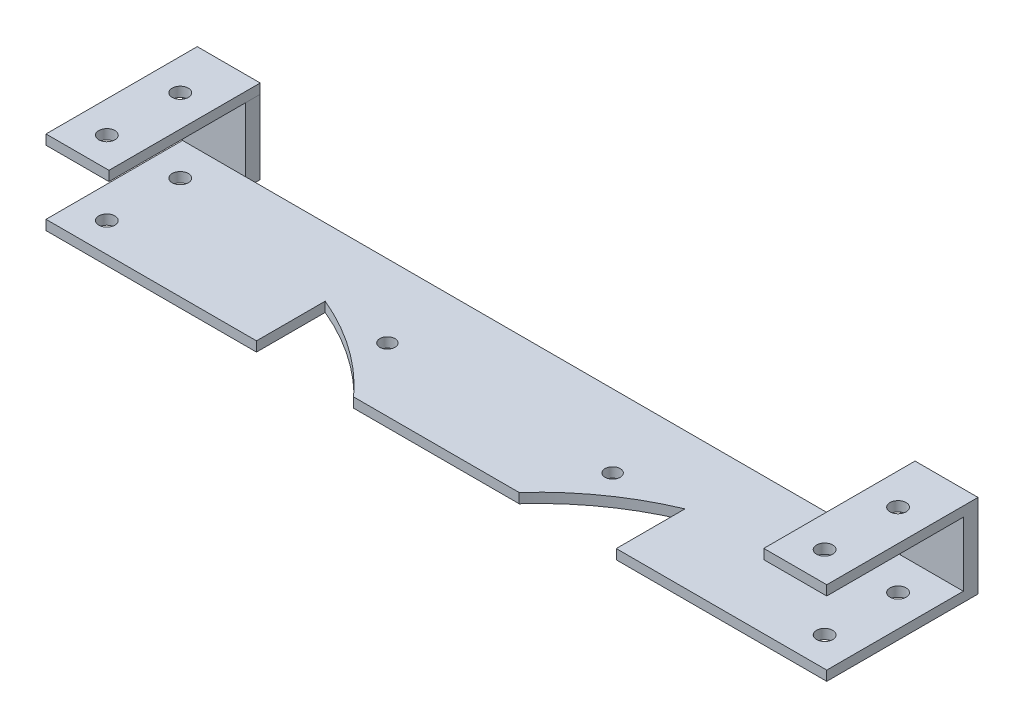
ISO-10303-21;
HEADER;
FILE_DESCRIPTION(('STEP AP214'),'2;1');
FILE_NAME('part.step','',(''),(''),'','','');
FILE_SCHEMA(('AUTOMOTIVE_DESIGN { 1 0 10303 214 1 1 1 1 }'));
ENDSEC;
DATA;
#1=APPLICATION_CONTEXT('core data for automotive mechanical design processes');
#2=APPLICATION_PROTOCOL_DEFINITION('international standard','automotive_design',2000,#1);
#3=PRODUCT_CONTEXT('',#1,'mechanical');
#4=PRODUCT('Part','Part','',(#3));
#5=PRODUCT_RELATED_PRODUCT_CATEGORY('part','',(#4));
#6=PRODUCT_DEFINITION_FORMATION('','',#4);
#7=PRODUCT_DEFINITION_CONTEXT('part definition',#1,'design');
#8=PRODUCT_DEFINITION('design','',#6,#7);
#9=PRODUCT_DEFINITION_SHAPE('','',#8);
#10=(LENGTH_UNIT() NAMED_UNIT(*) SI_UNIT(.MILLI.,.METRE.));
#11=(NAMED_UNIT(*) PLANE_ANGLE_UNIT() SI_UNIT($,.RADIAN.));
#12=(NAMED_UNIT(*) SI_UNIT($,.STERADIAN.) SOLID_ANGLE_UNIT());
#13=UNCERTAINTY_MEASURE_WITH_UNIT(LENGTH_MEASURE(1.E-05),#10,'distance_accuracy_value','');
#14=(GEOMETRIC_REPRESENTATION_CONTEXT(3) GLOBAL_UNCERTAINTY_ASSIGNED_CONTEXT((#13)) GLOBAL_UNIT_ASSIGNED_CONTEXT((#10,
#11,#12)) REPRESENTATION_CONTEXT('',''));
#15=CARTESIAN_POINT('',(0.,0.,0.));
#16=DIRECTION('',(0.,0.,1.));
#17=DIRECTION('',(1.,0.,0.));
#18=AXIS2_PLACEMENT_3D('',#15,#16,#17);
#19=CARTESIAN_POINT('',(-8.64000000000009,17.1,0.));
#20=DIRECTION('',(-1.,0.,0.));
#21=DIRECTION('',(0.,0.,1.));
#22=AXIS2_PLACEMENT_3D('',#19,#20,#21);
#23=PLANE('',#22);
#24=DIRECTION('',(0.,0.,-1.));
#25=VECTOR('',#24,1.);
#26=CARTESIAN_POINT('',(-8.64000000000009,15.1,0.));
#27=LINE('',#26,#25);
#28=CARTESIAN_POINT('',(-8.64000000000002,15.1,-37.4));
#29=VERTEX_POINT('',#28);
#30=CARTESIAN_POINT('',(-8.64000000000001,15.1,-68.3));
#31=VERTEX_POINT('',#30);
#32=EDGE_CURVE('E121',#29,#31,#27,.T.);
#33=ORIENTED_EDGE('',*,*,#32,.T.);
#34=DIRECTION('',(0.,-1.,0.));
#35=VECTOR('',#34,1.);
#36=CARTESIAN_POINT('',(-8.64000000000001,17.1,-68.3));
#37=LINE('',#36,#35);
#38=CARTESIAN_POINT('',(-8.64000000000001,17.1,-68.3));
#39=VERTEX_POINT('',#38);
#40=EDGE_CURVE('E12',#39,#31,#37,.T.);
#41=ORIENTED_EDGE('',*,*,#40,.F.);
#42=DIRECTION('',(0.,0.,-1.));
#43=VECTOR('',#42,1.);
#44=CARTESIAN_POINT('',(-8.64000000000009,17.1,0.));
#45=LINE('',#44,#43);
#46=CARTESIAN_POINT('',(-8.64000000000002,17.1,-37.4));
#47=VERTEX_POINT('',#46);
#48=EDGE_CURVE('E101',#47,#39,#45,.T.);
#49=ORIENTED_EDGE('',*,*,#48,.F.);
#50=DIRECTION('',(0.,-1.,0.));
#51=VECTOR('',#50,1.);
#52=CARTESIAN_POINT('',(-8.64000000000002,17.1,-37.4));
#53=LINE('',#52,#51);
#54=EDGE_CURVE('E67',#47,#29,#53,.T.);
#55=ORIENTED_EDGE('',*,*,#54,.T.);
#56=EDGE_LOOP('',(#33,#41,#49,#55));
#57=FACE_BOUND('',#56,.T.);
#58=ADVANCED_FACE('F51',(#57),#23,.F.);
#59=CARTESIAN_POINT('',(0.,17.1,-68.3));
#60=DIRECTION('',(0.,0.,1.));
#61=DIRECTION('',(1.,0.,0.));
#62=AXIS2_PLACEMENT_3D('',#59,#60,#61);
#63=PLANE('',#62);
#64=DIRECTION('',(-1.,0.,0.));
#65=VECTOR('',#64,1.);
#66=CARTESIAN_POINT('',(0.,15.1,-68.3));
#67=LINE('',#66,#65);
#68=CARTESIAN_POINT('',(-21.5,15.1,-68.3));
#69=VERTEX_POINT('',#68);
#70=EDGE_CURVE('E106',#31,#69,#67,.T.);
#71=ORIENTED_EDGE('',*,*,#70,.T.);
#72=DIRECTION('',(0.,-1.,0.));
#73=VECTOR('',#72,1.);
#74=CARTESIAN_POINT('',(-21.5,17.1,-68.3));
#75=LINE('',#74,#73);
#76=CARTESIAN_POINT('',(-21.5,17.1,-68.3));
#77=VERTEX_POINT('',#76);
#78=EDGE_CURVE('E59',#77,#69,#75,.T.);
#79=ORIENTED_EDGE('',*,*,#78,.F.);
#80=DIRECTION('',(-1.,0.,0.));
#81=VECTOR('',#80,1.);
#82=CARTESIAN_POINT('',(0.,17.1,-68.3));
#83=LINE('',#82,#81);
#84=EDGE_CURVE('E93',#39,#77,#83,.T.);
#85=ORIENTED_EDGE('',*,*,#84,.F.);
#86=ORIENTED_EDGE('',*,*,#40,.T.);
#87=EDGE_LOOP('',(#71,#79,#85,#86));
#88=FACE_BOUND('',#87,.T.);
#89=ADVANCED_FACE('F105',(#88),#63,.F.);
#90=CARTESIAN_POINT('',(-21.4999999999999,17.1,0.));
#91=DIRECTION('',(1.,0.,0.));
#92=DIRECTION('',(0.,0.,-1.));
#93=AXIS2_PLACEMENT_3D('',#90,#91,#92);
#94=PLANE('',#93);
#95=DIRECTION('',(0.,0.,1.));
#96=VECTOR('',#95,1.);
#97=CARTESIAN_POINT('',(-21.4999999999999,15.1,0.));
#98=LINE('',#97,#96);
#99=CARTESIAN_POINT('',(-21.5,15.1,-37.4));
#100=VERTEX_POINT('',#99);
#101=EDGE_CURVE('E124',#69,#100,#98,.T.);
#102=ORIENTED_EDGE('',*,*,#101,.T.);
#103=DIRECTION('',(0.,-1.,0.));
#104=VECTOR('',#103,1.);
#105=CARTESIAN_POINT('',(-21.5,17.1,-37.4));
#106=LINE('',#105,#104);
#107=CARTESIAN_POINT('',(-21.5,17.1,-37.4));
#108=VERTEX_POINT('',#107);
#109=EDGE_CURVE('E82',#108,#100,#106,.T.);
#110=ORIENTED_EDGE('',*,*,#109,.F.);
#111=DIRECTION('',(0.,0.,1.));
#112=VECTOR('',#111,1.);
#113=CARTESIAN_POINT('',(-21.4999999999999,17.1,0.));
#114=LINE('',#113,#112);
#115=EDGE_CURVE('E100',#77,#108,#114,.T.);
#116=ORIENTED_EDGE('',*,*,#115,.F.);
#117=ORIENTED_EDGE('',*,*,#78,.T.);
#118=EDGE_LOOP('',(#102,#110,#116,#117));
#119=FACE_BOUND('',#118,.T.);
#120=ADVANCED_FACE('F109',(#119),#94,.F.);
#121=CARTESIAN_POINT('',(-15.07,17.1,-43.4));
#122=DIRECTION('',(0.,-1.,0.));
#123=DIRECTION('',(0.,0.,-1.));
#124=AXIS2_PLACEMENT_3D('',#121,#122,#123);
#125=CYLINDRICAL_SURFACE('',#124,1.65);
#126=CARTESIAN_POINT('',(-15.07,17.1,-43.4));
#127=DIRECTION('',(0.,1.,0.));
#128=DIRECTION('',(0.,0.,1.));
#129=AXIS2_PLACEMENT_3D('',#126,#127,#128);
#130=CIRCLE('',#129,1.65);
#131=CARTESIAN_POINT('',(-15.07,17.1,-41.75));
#132=VERTEX_POINT('',#131);
#133=EDGE_CURVE('E112',#132,#132,#130,.F.);
#134=ORIENTED_EDGE('',*,*,#133,.F.);
#135=EDGE_LOOP('',(#134));
#136=FACE_BOUND('',#135,.T.);
#137=CARTESIAN_POINT('',(-15.07,15.1,-43.4));
#138=DIRECTION('',(0.,1.,0.));
#139=DIRECTION('',(0.,0.,1.));
#140=AXIS2_PLACEMENT_3D('',#137,#138,#139);
#141=CIRCLE('',#140,1.65);
#142=CARTESIAN_POINT('',(-15.07,15.1,-41.75));
#143=VERTEX_POINT('',#142);
#144=EDGE_CURVE('E129',#143,#143,#141,.F.);
#145=ORIENTED_EDGE('',*,*,#144,.T.);
#146=EDGE_LOOP('',(#145));
#147=FACE_BOUND('',#146,.T.);
#148=ADVANCED_FACE('F156',(#136,#147),#125,.F.);
#149=CARTESIAN_POINT('',(0.,17.1,-37.4));
#150=DIRECTION('',(0.,0.,1.));
#151=DIRECTION('',(1.,0.,0.));
#152=AXIS2_PLACEMENT_3D('',#149,#150,#151);
#153=PLANE('',#152);
#154=DIRECTION('',(-1.,0.,0.));
#155=VECTOR('',#154,1.);
#156=CARTESIAN_POINT('',(0.,15.1,-37.4));
#157=LINE('',#156,#155);
#158=EDGE_CURVE('E126',#29,#100,#157,.T.);
#159=ORIENTED_EDGE('',*,*,#158,.F.);
#160=ORIENTED_EDGE('',*,*,#54,.F.);
#161=DIRECTION('',(-1.,0.,0.));
#162=VECTOR('',#161,1.);
#163=CARTESIAN_POINT('',(0.,17.1,-37.4));
#164=LINE('',#163,#162);
#165=EDGE_CURVE('E110',#47,#108,#164,.T.);
#166=ORIENTED_EDGE('',*,*,#165,.T.);
#167=ORIENTED_EDGE('',*,*,#109,.T.);
#168=EDGE_LOOP('',(#159,#160,#166,#167));
#169=FACE_BOUND('',#168,.T.);
#170=ADVANCED_FACE('F154',(#169),#153,.T.);
#171=CARTESIAN_POINT('',(-15.07,17.1,-58.4));
#172=DIRECTION('',(0.,-1.,0.));
#173=DIRECTION('',(0.,0.,-1.));
#174=AXIS2_PLACEMENT_3D('',#171,#172,#173);
#175=CYLINDRICAL_SURFACE('',#174,1.65);
#176=CARTESIAN_POINT('',(-15.07,17.1,-58.4));
#177=DIRECTION('',(0.,1.,0.));
#178=DIRECTION('',(0.,0.,1.));
#179=AXIS2_PLACEMENT_3D('',#176,#177,#178);
#180=CIRCLE('',#179,1.65);
#181=CARTESIAN_POINT('',(-15.07,17.1,-56.75));
#182=VERTEX_POINT('',#181);
#183=EDGE_CURVE('E118',#182,#182,#180,.F.);
#184=ORIENTED_EDGE('',*,*,#183,.F.);
#185=EDGE_LOOP('',(#184));
#186=FACE_BOUND('',#185,.T.);
#187=CARTESIAN_POINT('',(-15.07,15.1,-58.4));
#188=DIRECTION('',(0.,1.,0.));
#189=DIRECTION('',(0.,0.,1.));
#190=AXIS2_PLACEMENT_3D('',#187,#188,#189);
#191=CIRCLE('',#190,1.65);
#192=CARTESIAN_POINT('',(-15.07,15.1,-56.75));
#193=VERTEX_POINT('',#192);
#194=EDGE_CURVE('E132',#193,#193,#191,.F.);
#195=ORIENTED_EDGE('',*,*,#194,.T.);
#196=EDGE_LOOP('',(#195));
#197=FACE_BOUND('',#196,.T.);
#198=ADVANCED_FACE('F138',(#186,#197),#175,.F.);
#199=CARTESIAN_POINT('',(0.,17.1,0.));
#200=DIRECTION('',(0.,1.,0.));
#201=DIRECTION('',(0.,0.,1.));
#202=AXIS2_PLACEMENT_3D('',#199,#200,#201);
#203=PLANE('',#202);
#204=ORIENTED_EDGE('',*,*,#48,.T.);
#205=ORIENTED_EDGE('',*,*,#84,.T.);
#206=ORIENTED_EDGE('',*,*,#115,.T.);
#207=ORIENTED_EDGE('',*,*,#165,.F.);
#208=EDGE_LOOP('',(#204,#205,#206,#207));
#209=FACE_BOUND('',#208,.T.);
#210=ORIENTED_EDGE('',*,*,#133,.T.);
#211=EDGE_LOOP('',(#210));
#212=FACE_BOUND('',#211,.T.);
#213=ORIENTED_EDGE('',*,*,#183,.T.);
#214=EDGE_LOOP('',(#213));
#215=FACE_BOUND('',#214,.T.);
#216=ADVANCED_FACE('F96',(#209,#212,#215),#203,.T.);
#217=CARTESIAN_POINT('',(0.,15.1,0.));
#218=DIRECTION('',(0.,1.,0.));
#219=DIRECTION('',(0.,0.,1.));
#220=AXIS2_PLACEMENT_3D('',#217,#218,#219);
#221=PLANE('',#220);
#222=ORIENTED_EDGE('',*,*,#32,.F.);
#223=ORIENTED_EDGE('',*,*,#158,.T.);
#224=ORIENTED_EDGE('',*,*,#101,.F.);
#225=ORIENTED_EDGE('',*,*,#70,.F.);
#226=EDGE_LOOP('',(#222,#223,#224,#225));
#227=FACE_BOUND('',#226,.T.);
#228=ORIENTED_EDGE('',*,*,#144,.F.);
#229=EDGE_LOOP('',(#228));
#230=FACE_BOUND('',#229,.T.);
#231=ORIENTED_EDGE('',*,*,#194,.F.);
#232=EDGE_LOOP('',(#231));
#233=FACE_BOUND('',#232,.T.);
#234=ADVANCED_FACE('F140',(#227,#230,#233),#221,.F.);
#235=CLOSED_SHELL('',(#58,#89,#120,#148,#170,#198,#216,#234));
#236=MANIFOLD_SOLID_BREP('B2',#235);
#237=CARTESIAN_POINT('',(0.,2.,0.));
#238=DIRECTION('',(0.,1.,0.));
#239=DIRECTION('',(0.,0.,1.));
#240=AXIS2_PLACEMENT_3D('',#237,#238,#239);
#241=PLANE('',#240);
#242=CARTESIAN_POINT('',(-15.07,2.,-43.4));
#243=DIRECTION('',(0.,1.,0.));
#244=DIRECTION('',(0.,0.,1.));
#245=AXIS2_PLACEMENT_3D('',#242,#243,#244);
#246=CIRCLE('',#245,1.65);
#247=CARTESIAN_POINT('',(-15.07,2.,-41.75));
#248=VERTEX_POINT('',#247);
#249=EDGE_CURVE('E467',#248,#248,#246,.F.);
#250=ORIENTED_EDGE('',*,*,#249,.T.);
#251=EDGE_LOOP('',(#250));
#252=FACE_BOUND('',#251,.T.);
#253=CARTESIAN_POINT('',(-15.07,2.,-58.4));
#254=DIRECTION('',(0.,1.,0.));
#255=DIRECTION('',(0.,0.,1.));
#256=AXIS2_PLACEMENT_3D('',#253,#254,#255);
#257=CIRCLE('',#256,1.65);
#258=CARTESIAN_POINT('',(-15.07,2.,-56.75));
#259=VERTEX_POINT('',#258);
#260=EDGE_CURVE('E493',#259,#259,#257,.F.);
#261=ORIENTED_EDGE('',*,*,#260,.T.);
#262=EDGE_LOOP('',(#261));
#263=FACE_BOUND('',#262,.T.);
#264=CARTESIAN_POINT('',(35.25,2.,-50.4));
#265=DIRECTION('',(0.,1.,0.));
#266=DIRECTION('',(0.,0.,1.));
#267=AXIS2_PLACEMENT_3D('',#264,#265,#266);
#268=CIRCLE('',#267,1.55);
#269=CARTESIAN_POINT('',(35.25,2.,-48.85));
#270=VERTEX_POINT('',#269);
#271=EDGE_CURVE('E496',#270,#270,#268,.T.);
#272=ORIENTED_EDGE('',*,*,#271,.F.);
#273=EDGE_LOOP('',(#272));
#274=FACE_BOUND('',#273,.T.);
#275=CARTESIAN_POINT('',(81.25,2.,-50.4));
#276=DIRECTION('',(0.,1.,0.));
#277=DIRECTION('',(0.,0.,1.));
#278=AXIS2_PLACEMENT_3D('',#275,#276,#277);
#279=CIRCLE('',#278,1.55000000000001);
#280=CARTESIAN_POINT('',(81.25,2.,-48.85));
#281=VERTEX_POINT('',#280);
#282=EDGE_CURVE('E499',#281,#281,#279,.F.);
#283=ORIENTED_EDGE('',*,*,#282,.T.);
#284=EDGE_LOOP('',(#283));
#285=FACE_BOUND('',#284,.T.);
#286=CARTESIAN_POINT('',(131.57,2.,-58.4));
#287=DIRECTION('',(0.,1.,0.));
#288=DIRECTION('',(0.,0.,1.));
#289=AXIS2_PLACEMENT_3D('',#286,#287,#288);
#290=CIRCLE('',#289,1.65000000000002);
#291=CARTESIAN_POINT('',(131.57,2.,-56.75));
#292=VERTEX_POINT('',#291);
#293=EDGE_CURVE('E502',#292,#292,#290,.T.);
#294=ORIENTED_EDGE('',*,*,#293,.F.);
#295=EDGE_LOOP('',(#294));
#296=FACE_BOUND('',#295,.T.);
#297=CARTESIAN_POINT('',(131.57,2.,-43.4));
#298=DIRECTION('',(0.,1.,0.));
#299=DIRECTION('',(0.,0.,1.));
#300=AXIS2_PLACEMENT_3D('',#297,#298,#299);
#301=CIRCLE('',#300,1.65000000000002);
#302=CARTESIAN_POINT('',(131.57,2.,-41.75));
#303=VERTEX_POINT('',#302);
#304=EDGE_CURVE('E505',#303,#303,#301,.T.);
#305=ORIENTED_EDGE('',*,*,#304,.F.);
#306=EDGE_LOOP('',(#305));
#307=FACE_BOUND('',#306,.T.);
#308=DIRECTION('',(1.,0.,0.));
#309=VECTOR('',#308,1.);
#310=CARTESIAN_POINT('',(0.,2.,-65.3));
#311=LINE('',#310,#309);
#312=CARTESIAN_POINT('',(-8.64000000000002,2.00000000000001,-65.3));
#313=VERTEX_POINT('',#312);
#314=CARTESIAN_POINT('',(125.14,2.,-65.3));
#315=VERTEX_POINT('',#314);
#316=EDGE_CURVE('E489',#313,#315,#311,.T.);
#317=ORIENTED_EDGE('',*,*,#316,.F.);
#318=DIRECTION('',(-1.,0.,0.));
#319=VECTOR('',#318,1.);
#320=CARTESIAN_POINT('',(0.,2.,-65.3));
#321=LINE('',#320,#319);
#322=CARTESIAN_POINT('',(-21.5,2.,-65.3));
#323=VERTEX_POINT('',#322);
#324=EDGE_CURVE('E412',#313,#323,#321,.T.);
#325=ORIENTED_EDGE('',*,*,#324,.T.);
#326=DIRECTION('',(0.,0.,-1.));
#327=VECTOR('',#326,1.);
#328=CARTESIAN_POINT('',(-21.5,2.,0.));
#329=LINE('',#328,#327);
#330=CARTESIAN_POINT('',(-21.5,2.,-37.4));
#331=VERTEX_POINT('',#330);
#332=EDGE_CURVE('E397',#331,#323,#329,.T.);
#333=ORIENTED_EDGE('',*,*,#332,.F.);
#334=DIRECTION('',(-1.,0.,0.));
#335=VECTOR('',#334,1.);
#336=CARTESIAN_POINT('',(0.,2.,-37.4));
#337=LINE('',#336,#335);
#338=CARTESIAN_POINT('',(21.5,2.,-37.4));
#339=VERTEX_POINT('',#338);
#340=EDGE_CURVE('E470',#339,#331,#337,.T.);
#341=ORIENTED_EDGE('',*,*,#340,.F.);
#342=DIRECTION('',(0.,0.,-1.));
#343=VECTOR('',#342,1.);
#344=CARTESIAN_POINT('',(21.5,2.,0.));
#345=LINE('',#344,#343);
#346=CARTESIAN_POINT('',(21.5,2.,-51.4374620291476));
#347=VERTEX_POINT('',#346);
#348=EDGE_CURVE('E474',#339,#347,#345,.T.);
#349=ORIENTED_EDGE('',*,*,#348,.T.);
#350=CARTESIAN_POINT('',(0.,2.,0.));
#351=DIRECTION('',(0.,1.,0.));
#352=DIRECTION('',(0.,0.,1.));
#353=AXIS2_PLACEMENT_3D('',#350,#351,#352);
#354=CIRCLE('',#353,55.75);
#355=CARTESIAN_POINT('',(41.3437117346762,2.,-37.4));
#356=VERTEX_POINT('',#355);
#357=EDGE_CURVE('E476',#356,#347,#354,.T.);
#358=ORIENTED_EDGE('',*,*,#357,.F.);
#359=DIRECTION('',(1.,0.,0.));
#360=VECTOR('',#359,1.);
#361=CARTESIAN_POINT('',(0.,2.,-37.4));
#362=LINE('',#361,#360);
#363=CARTESIAN_POINT('',(75.1562882653239,2.,-37.4));
#364=VERTEX_POINT('',#363);
#365=EDGE_CURVE('E479',#356,#364,#362,.T.);
#366=ORIENTED_EDGE('',*,*,#365,.T.);
#367=CARTESIAN_POINT('',(116.5,2.,0.));
#368=DIRECTION('',(0.,1.,0.));
#369=DIRECTION('',(0.,0.,1.));
#370=AXIS2_PLACEMENT_3D('',#367,#368,#369);
#371=CIRCLE('',#370,55.75);
#372=CARTESIAN_POINT('',(95.,2.,-51.4374620291476));
#373=VERTEX_POINT('',#372);
#374=EDGE_CURVE('E482',#364,#373,#371,.F.);
#375=ORIENTED_EDGE('',*,*,#374,.T.);
#376=DIRECTION('',(0.,0.,-1.));
#377=VECTOR('',#376,1.);
#378=CARTESIAN_POINT('',(95.,2.,0.));
#379=LINE('',#378,#377);
#380=CARTESIAN_POINT('',(95.,2.,-37.4));
#381=VERTEX_POINT('',#380);
#382=EDGE_CURVE('E485',#381,#373,#379,.T.);
#383=ORIENTED_EDGE('',*,*,#382,.F.);
#384=CARTESIAN_POINT('',(138.,2.,-37.4));
#385=VERTEX_POINT('',#384);
#386=EDGE_CURVE('E483',#381,#385,#362,.T.);
#387=ORIENTED_EDGE('',*,*,#386,.T.);
#388=DIRECTION('',(0.,0.,-1.));
#389=VECTOR('',#388,1.);
#390=CARTESIAN_POINT('',(138.,2.,0.));
#391=LINE('',#390,#389);
#392=CARTESIAN_POINT('',(138.,2.,-65.3));
#393=VERTEX_POINT('',#392);
#394=EDGE_CURVE('E284',#385,#393,#391,.T.);
#395=ORIENTED_EDGE('',*,*,#394,.T.);
#396=DIRECTION('',(1.,0.,0.));
#397=VECTOR('',#396,1.);
#398=CARTESIAN_POINT('',(0.,2.,-65.3));
#399=LINE('',#398,#397);
#400=EDGE_CURVE('E464',#315,#393,#399,.T.);
#401=ORIENTED_EDGE('',*,*,#400,.F.);
#402=EDGE_LOOP('',(#317,#325,#333,#341,#349,#358,#366,#375,#383,#387,#395,#401));
#403=FACE_BOUND('',#402,.T.);
#404=ADVANCED_FACE('F261',(#252,#263,#274,#285,#296,#307,#403),#241,.T.);
#405=CARTESIAN_POINT('',(0.,2.,-37.4));
#406=DIRECTION('',(0.,0.,1.));
#407=DIRECTION('',(1.,0.,0.));
#408=AXIS2_PLACEMENT_3D('',#405,#406,#407);
#409=PLANE('',#408);
#410=DIRECTION('',(-1.,0.,0.));
#411=VECTOR('',#410,1.);
#412=CARTESIAN_POINT('',(0.,0.,-37.4));
#413=LINE('',#412,#411);
#414=CARTESIAN_POINT('',(21.5,0.,-37.4));
#415=VERTEX_POINT('',#414);
#416=CARTESIAN_POINT('',(-21.5,0.,-37.4));
#417=VERTEX_POINT('',#416);
#418=EDGE_CURVE('E511',#415,#417,#413,.T.);
#419=ORIENTED_EDGE('',*,*,#418,.F.);
#420=DIRECTION('',(0.,-1.,0.));
#421=VECTOR('',#420,1.);
#422=CARTESIAN_POINT('',(21.5,2.,-37.4));
#423=LINE('',#422,#421);
#424=EDGE_CURVE('E49',#339,#415,#423,.T.);
#425=ORIENTED_EDGE('',*,*,#424,.F.);
#426=ORIENTED_EDGE('',*,*,#340,.T.);
#427=DIRECTION('',(0.,-1.,0.));
#428=VECTOR('',#427,1.);
#429=CARTESIAN_POINT('',(-21.5,2.,-37.4));
#430=LINE('',#429,#428);
#431=EDGE_CURVE('E508',#331,#417,#430,.T.);
#432=ORIENTED_EDGE('',*,*,#431,.T.);
#433=EDGE_LOOP('',(#419,#425,#426,#432));
#434=FACE_BOUND('',#433,.T.);
#435=ADVANCED_FACE('F611',(#434),#409,.T.);
#436=CARTESIAN_POINT('',(21.5,2.,0.));
#437=DIRECTION('',(-1.,0.,0.));
#438=DIRECTION('',(0.,0.,1.));
#439=AXIS2_PLACEMENT_3D('',#436,#437,#438);
#440=PLANE('',#439);
#441=DIRECTION('',(0.,0.,-1.));
#442=VECTOR('',#441,1.);
#443=CARTESIAN_POINT('',(21.5,0.,0.));
#444=LINE('',#443,#442);
#445=CARTESIAN_POINT('',(21.5,0.,-51.4374620291476));
#446=VERTEX_POINT('',#445);
#447=EDGE_CURVE('E514',#415,#446,#444,.T.);
#448=ORIENTED_EDGE('',*,*,#447,.T.);
#449=DIRECTION('',(0.,-1.,0.));
#450=VECTOR('',#449,1.);
#451=CARTESIAN_POINT('',(21.5,2.,-51.4374620291476));
#452=LINE('',#451,#450);
#453=EDGE_CURVE('E269',#347,#446,#452,.T.);
#454=ORIENTED_EDGE('',*,*,#453,.F.);
#455=ORIENTED_EDGE('',*,*,#348,.F.);
#456=ORIENTED_EDGE('',*,*,#424,.T.);
#457=EDGE_LOOP('',(#448,#454,#455,#456));
#458=FACE_BOUND('',#457,.T.);
#459=ADVANCED_FACE('F597',(#458),#440,.F.);
#460=CARTESIAN_POINT('',(0.,2.,0.));
#461=DIRECTION('',(0.,-1.,0.));
#462=DIRECTION('',(0.,0.,-1.));
#463=AXIS2_PLACEMENT_3D('',#460,#461,#462);
#464=CYLINDRICAL_SURFACE('',#463,55.75);
#465=CARTESIAN_POINT('',(0.,0.,0.));
#466=DIRECTION('',(0.,1.,0.));
#467=DIRECTION('',(0.,0.,1.));
#468=AXIS2_PLACEMENT_3D('',#465,#466,#467);
#469=CIRCLE('',#468,55.75);
#470=CARTESIAN_POINT('',(41.3437117346762,0.,-37.4));
#471=VERTEX_POINT('',#470);
#472=EDGE_CURVE('E517',#471,#446,#469,.T.);
#473=ORIENTED_EDGE('',*,*,#472,.F.);
#474=DIRECTION('',(0.,-1.,0.));
#475=VECTOR('',#474,1.);
#476=CARTESIAN_POINT('',(41.3437117346762,2.,-37.4));
#477=LINE('',#476,#475);
#478=EDGE_CURVE('E588',#356,#471,#477,.T.);
#479=ORIENTED_EDGE('',*,*,#478,.F.);
#480=ORIENTED_EDGE('',*,*,#357,.T.);
#481=ORIENTED_EDGE('',*,*,#453,.T.);
#482=EDGE_LOOP('',(#473,#479,#480,#481));
#483=FACE_BOUND('',#482,.T.);
#484=ADVANCED_FACE('F592',(#483),#464,.F.);
#485=CARTESIAN_POINT('',(0.,2.,-37.4));
#486=DIRECTION('',(0.,0.,-1.));
#487=DIRECTION('',(-1.,0.,0.));
#488=AXIS2_PLACEMENT_3D('',#485,#486,#487);
#489=PLANE('',#488);
#490=DIRECTION('',(1.,0.,0.));
#491=VECTOR('',#490,1.);
#492=CARTESIAN_POINT('',(0.,0.,-37.4));
#493=LINE('',#492,#491);
#494=CARTESIAN_POINT('',(75.1562882653239,0.,-37.4));
#495=VERTEX_POINT('',#494);
#496=EDGE_CURVE('E520',#471,#495,#493,.T.);
#497=ORIENTED_EDGE('',*,*,#496,.T.);
#498=DIRECTION('',(0.,-1.,0.));
#499=VECTOR('',#498,1.);
#500=CARTESIAN_POINT('',(75.1562882653239,2.,-37.4));
#501=LINE('',#500,#499);
#502=EDGE_CURVE('E585',#364,#495,#501,.T.);
#503=ORIENTED_EDGE('',*,*,#502,.F.);
#504=ORIENTED_EDGE('',*,*,#365,.F.);
#505=ORIENTED_EDGE('',*,*,#478,.T.);
#506=EDGE_LOOP('',(#497,#503,#504,#505));
#507=FACE_BOUND('',#506,.T.);
#508=ADVANCED_FACE('F606',(#507),#489,.F.);
#509=CARTESIAN_POINT('',(116.5,2.,0.));
#510=DIRECTION('',(0.,-1.,0.));
#511=DIRECTION('',(0.,0.,-1.));
#512=AXIS2_PLACEMENT_3D('',#509,#510,#511);
#513=CYLINDRICAL_SURFACE('',#512,55.75);
#514=CARTESIAN_POINT('',(116.5,0.,0.));
#515=DIRECTION('',(0.,1.,0.));
#516=DIRECTION('',(0.,0.,1.));
#517=AXIS2_PLACEMENT_3D('',#514,#515,#516);
#518=CIRCLE('',#517,55.75);
#519=CARTESIAN_POINT('',(95.,0.,-51.4374620291476));
#520=VERTEX_POINT('',#519);
#521=EDGE_CURVE('E523',#495,#520,#518,.F.);
#522=ORIENTED_EDGE('',*,*,#521,.T.);
#523=DIRECTION('',(0.,-1.,0.));
#524=VECTOR('',#523,1.);
#525=CARTESIAN_POINT('',(95.,2.,-51.4374620291476));
#526=LINE('',#525,#524);
#527=EDGE_CURVE('E583',#373,#520,#526,.T.);
#528=ORIENTED_EDGE('',*,*,#527,.F.);
#529=ORIENTED_EDGE('',*,*,#374,.F.);
#530=ORIENTED_EDGE('',*,*,#502,.T.);
#531=EDGE_LOOP('',(#522,#528,#529,#530));
#532=FACE_BOUND('',#531,.T.);
#533=ADVANCED_FACE('F659',(#532),#513,.F.);
#534=CARTESIAN_POINT('',(95.,2.,0.));
#535=DIRECTION('',(-1.,0.,0.));
#536=DIRECTION('',(0.,0.,1.));
#537=AXIS2_PLACEMENT_3D('',#534,#535,#536);
#538=PLANE('',#537);
#539=DIRECTION('',(0.,0.,-1.));
#540=VECTOR('',#539,1.);
#541=CARTESIAN_POINT('',(95.,0.,0.));
#542=LINE('',#541,#540);
#543=CARTESIAN_POINT('',(95.,0.,-37.4));
#544=VERTEX_POINT('',#543);
#545=EDGE_CURVE('E527',#544,#520,#542,.T.);
#546=ORIENTED_EDGE('',*,*,#545,.F.);
#547=DIRECTION('',(0.,-1.,0.));
#548=VECTOR('',#547,1.);
#549=CARTESIAN_POINT('',(95.,2.,-37.4));
#550=LINE('',#549,#548);
#551=EDGE_CURVE('E581',#381,#544,#550,.T.);
#552=ORIENTED_EDGE('',*,*,#551,.F.);
#553=ORIENTED_EDGE('',*,*,#382,.T.);
#554=ORIENTED_EDGE('',*,*,#527,.T.);
#555=EDGE_LOOP('',(#546,#552,#553,#554));
#556=FACE_BOUND('',#555,.T.);
#557=ADVANCED_FACE('F656',(#556),#538,.T.);
#558=CARTESIAN_POINT('',(138.,0.,-37.4));
#559=VERTEX_POINT('',#558);
#560=EDGE_CURVE('E524',#544,#559,#493,.T.);
#561=ORIENTED_EDGE('',*,*,#560,.T.);
#562=DIRECTION('',(0.,-1.,0.));
#563=VECTOR('',#562,1.);
#564=CARTESIAN_POINT('',(138.,2.,-37.4));
#565=LINE('',#564,#563);
#566=EDGE_CURVE('E578',#385,#559,#565,.T.);
#567=ORIENTED_EDGE('',*,*,#566,.F.);
#568=ORIENTED_EDGE('',*,*,#386,.F.);
#569=ORIENTED_EDGE('',*,*,#551,.T.);
#570=EDGE_LOOP('',(#561,#567,#568,#569));
#571=FACE_BOUND('',#570,.T.);
#572=ADVANCED_FACE('F653',(#571),#489,.F.);
#573=CARTESIAN_POINT('',(138.,2.,0.));
#574=DIRECTION('',(-1.,0.,0.));
#575=DIRECTION('',(0.,0.,1.));
#576=AXIS2_PLACEMENT_3D('',#573,#574,#575);
#577=PLANE('',#576);
#578=DIRECTION('',(0.,0.,-1.));
#579=VECTOR('',#578,1.);
#580=CARTESIAN_POINT('',(138.,0.,0.));
#581=LINE('',#580,#579);
#582=CARTESIAN_POINT('',(138.,0.,-68.3));
#583=VERTEX_POINT('',#582);
#584=EDGE_CURVE('E530',#559,#583,#581,.T.);
#585=ORIENTED_EDGE('',*,*,#584,.T.);
#586=DIRECTION('',(0.,-1.,0.));
#587=VECTOR('',#586,1.);
#588=CARTESIAN_POINT('',(138.,2.,-68.3));
#589=LINE('',#588,#587);
#590=CARTESIAN_POINT('',(138.,17.1,-68.3));
#591=VERTEX_POINT('',#590);
#592=EDGE_CURVE('E575',#591,#583,#589,.T.);
#593=ORIENTED_EDGE('',*,*,#592,.F.);
#594=DIRECTION('',(0.,0.,-1.));
#595=VECTOR('',#594,1.);
#596=CARTESIAN_POINT('',(138.,17.1,0.));
#597=LINE('',#596,#595);
#598=CARTESIAN_POINT('',(138.,17.1,-37.4));
#599=VERTEX_POINT('',#598);
#600=EDGE_CURVE('E432',#599,#591,#597,.T.);
#601=ORIENTED_EDGE('',*,*,#600,.F.);
#602=DIRECTION('',(0.,-1.,0.));
#603=VECTOR('',#602,1.);
#604=CARTESIAN_POINT('',(138.,17.1,-37.4));
#605=LINE('',#604,#603);
#606=CARTESIAN_POINT('',(138.,15.1,-37.4));
#607=VERTEX_POINT('',#606);
#608=EDGE_CURVE('E438',#599,#607,#605,.T.);
#609=ORIENTED_EDGE('',*,*,#608,.T.);
#610=DIRECTION('',(0.,0.,-1.));
#611=VECTOR('',#610,1.);
#612=CARTESIAN_POINT('',(138.,15.1,0.));
#613=LINE('',#612,#611);
#614=CARTESIAN_POINT('',(138.,15.1,-65.3));
#615=VERTEX_POINT('',#614);
#616=EDGE_CURVE('E424',#607,#615,#613,.T.);
#617=ORIENTED_EDGE('',*,*,#616,.T.);
#618=DIRECTION('',(0.,-1.,0.));
#619=VECTOR('',#618,1.);
#620=CARTESIAN_POINT('',(138.,28.3052868200581,-65.3));
#621=LINE('',#620,#619);
#622=EDGE_CURVE('E461',#615,#393,#621,.T.);
#623=ORIENTED_EDGE('',*,*,#622,.T.);
#624=ORIENTED_EDGE('',*,*,#394,.F.);
#625=ORIENTED_EDGE('',*,*,#566,.T.);
#626=EDGE_LOOP('',(#585,#593,#601,#609,#617,#623,#624,#625));
#627=FACE_BOUND('',#626,.T.);
#628=ADVANCED_FACE('F633',(#627),#577,.F.);
#629=CARTESIAN_POINT('',(0.,2.,-68.3));
#630=DIRECTION('',(0.,0.,-1.));
#631=DIRECTION('',(-1.,0.,0.));
#632=AXIS2_PLACEMENT_3D('',#629,#630,#631);
#633=PLANE('',#632);
#634=DIRECTION('',(1.,0.,0.));
#635=VECTOR('',#634,1.);
#636=CARTESIAN_POINT('',(0.,0.,-68.3));
#637=LINE('',#636,#635);
#638=CARTESIAN_POINT('',(125.14,0.,-68.3));
#639=VERTEX_POINT('',#638);
#640=EDGE_CURVE('E532',#639,#583,#637,.T.);
#641=ORIENTED_EDGE('',*,*,#640,.F.);
#642=DIRECTION('',(0.,-1.,0.));
#643=VECTOR('',#642,1.);
#644=CARTESIAN_POINT('',(125.14,2.,-68.3));
#645=LINE('',#644,#643);
#646=CARTESIAN_POINT('',(125.14,17.1,-68.3));
#647=VERTEX_POINT('',#646);
#648=EDGE_CURVE('E573',#647,#639,#645,.T.);
#649=ORIENTED_EDGE('',*,*,#648,.F.);
#650=DIRECTION('',(1.,0.,0.));
#651=VECTOR('',#650,1.);
#652=CARTESIAN_POINT('',(0.,17.1,-68.3));
#653=LINE('',#652,#651);
#654=EDGE_CURVE('E435',#647,#591,#653,.T.);
#655=ORIENTED_EDGE('',*,*,#654,.T.);
#656=ORIENTED_EDGE('',*,*,#592,.T.);
#657=EDGE_LOOP('',(#641,#649,#655,#656));
#658=FACE_BOUND('',#657,.T.);
#659=ADVANCED_FACE('F629',(#658),#633,.T.);
#660=CARTESIAN_POINT('',(125.14,2.,0.));
#661=DIRECTION('',(-1.,0.,0.));
#662=DIRECTION('',(0.,0.,1.));
#663=AXIS2_PLACEMENT_3D('',#660,#661,#662);
#664=PLANE('',#663);
#665=DIRECTION('',(0.,0.,-1.));
#666=VECTOR('',#665,1.);
#667=CARTESIAN_POINT('',(125.14,0.,0.));
#668=LINE('',#667,#666);
#669=CARTESIAN_POINT('',(125.14,0.,-65.3));
#670=VERTEX_POINT('',#669);
#671=EDGE_CURVE('E535',#670,#639,#668,.T.);
#672=ORIENTED_EDGE('',*,*,#671,.F.);
#673=DIRECTION('',(0.,-1.,0.));
#674=VECTOR('',#673,1.);
#675=CARTESIAN_POINT('',(125.14,2.,-65.3));
#676=LINE('',#675,#674);
#677=EDGE_CURVE('E571',#315,#670,#676,.T.);
#678=ORIENTED_EDGE('',*,*,#677,.F.);
#679=DIRECTION('',(0.,-1.,0.));
#680=VECTOR('',#679,1.);
#681=CARTESIAN_POINT('',(125.14,28.3052868200581,-65.3));
#682=LINE('',#681,#680);
#683=CARTESIAN_POINT('',(125.14,15.1,-65.3));
#684=VERTEX_POINT('',#683);
#685=EDGE_CURVE('E458',#684,#315,#682,.T.);
#686=ORIENTED_EDGE('',*,*,#685,.F.);
#687=DIRECTION('',(0.,0.,1.));
#688=VECTOR('',#687,1.);
#689=CARTESIAN_POINT('',(125.14,15.1,0.));
#690=LINE('',#689,#688);
#691=CARTESIAN_POINT('',(125.14,15.1,-37.4));
#692=VERTEX_POINT('',#691);
#693=EDGE_CURVE('E444',#684,#692,#690,.T.);
#694=ORIENTED_EDGE('',*,*,#693,.T.);
#695=DIRECTION('',(0.,-1.,0.));
#696=VECTOR('',#695,1.);
#697=CARTESIAN_POINT('',(125.14,17.1,-37.4));
#698=LINE('',#697,#696);
#699=CARTESIAN_POINT('',(125.14,17.1,-37.4));
#700=VERTEX_POINT('',#699);
#701=EDGE_CURVE('E452',#700,#692,#698,.T.);
#702=ORIENTED_EDGE('',*,*,#701,.F.);
#703=DIRECTION('',(0.,0.,1.));
#704=VECTOR('',#703,1.);
#705=CARTESIAN_POINT('',(125.14,17.1,0.));
#706=LINE('',#705,#704);
#707=EDGE_CURVE('E427',#647,#700,#706,.T.);
#708=ORIENTED_EDGE('',*,*,#707,.F.);
#709=ORIENTED_EDGE('',*,*,#648,.T.);
#710=EDGE_LOOP('',(#672,#678,#686,#694,#702,#708,#709));
#711=FACE_BOUND('',#710,.T.);
#712=ADVANCED_FACE('F624',(#711),#664,.T.);
#713=CARTESIAN_POINT('',(0.,2.,-65.3));
#714=DIRECTION('',(0.,0.,-1.));
#715=DIRECTION('',(-1.,0.,0.));
#716=AXIS2_PLACEMENT_3D('',#713,#714,#715);
#717=PLANE('',#716);
#718=DIRECTION('',(1.,0.,0.));
#719=VECTOR('',#718,1.);
#720=CARTESIAN_POINT('',(0.,0.,-65.3));
#721=LINE('',#720,#719);
#722=CARTESIAN_POINT('',(-8.64000000000002,0.,-65.3));
#723=VERTEX_POINT('',#722);
#724=EDGE_CURVE('E538',#723,#670,#721,.T.);
#725=ORIENTED_EDGE('',*,*,#724,.F.);
#726=DIRECTION('',(0.,-1.,0.));
#727=VECTOR('',#726,1.);
#728=CARTESIAN_POINT('',(-8.64000000000002,2.,-65.3));
#729=LINE('',#728,#727);
#730=EDGE_CURVE('E569',#313,#723,#729,.T.);
#731=ORIENTED_EDGE('',*,*,#730,.F.);
#732=ORIENTED_EDGE('',*,*,#316,.T.);
#733=ORIENTED_EDGE('',*,*,#677,.T.);
#734=EDGE_LOOP('',(#725,#731,#732,#733));
#735=FACE_BOUND('',#734,.T.);
#736=ADVANCED_FACE('F619',(#735),#717,.T.);
#737=CARTESIAN_POINT('',(-8.64000000000009,2.,0.));
#738=DIRECTION('',(-1.,0.,0.));
#739=DIRECTION('',(0.,0.,1.));
#740=AXIS2_PLACEMENT_3D('',#737,#738,#739);
#741=PLANE('',#740);
#742=DIRECTION('',(0.,0.,-1.));
#743=VECTOR('',#742,1.);
#744=CARTESIAN_POINT('',(-8.64000000000009,0.,0.));
#745=LINE('',#744,#743);
#746=CARTESIAN_POINT('',(-8.64000000000001,0.,-68.3));
#747=VERTEX_POINT('',#746);
#748=EDGE_CURVE('E541',#723,#747,#745,.T.);
#749=ORIENTED_EDGE('',*,*,#748,.T.);
#750=DIRECTION('',(0.,-1.,0.));
#751=VECTOR('',#750,1.);
#752=CARTESIAN_POINT('',(-8.64000000000001,2.,-68.3));
#753=LINE('',#752,#751);
#754=CARTESIAN_POINT('',(-8.64000000000001,15.1,-68.3));
#755=VERTEX_POINT('',#754);
#756=EDGE_CURVE('E566',#755,#747,#753,.T.);
#757=ORIENTED_EDGE('',*,*,#756,.F.);
#758=DIRECTION('',(0.,0.,-1.));
#759=VECTOR('',#758,1.);
#760=CARTESIAN_POINT('',(-8.64000000000009,15.1,0.));
#761=LINE('',#760,#759);
#762=CARTESIAN_POINT('',(-8.64000000000002,15.1,-65.3));
#763=VERTEX_POINT('',#762);
#764=EDGE_CURVE('E407',#763,#755,#761,.T.);
#765=ORIENTED_EDGE('',*,*,#764,.F.);
#766=DIRECTION('',(0.,-1.,0.));
#767=VECTOR('',#766,1.);
#768=CARTESIAN_POINT('',(-8.64000000000002,28.3052868200581,-65.3));
#769=LINE('',#768,#767);
#770=EDGE_CURVE('E399',#763,#313,#769,.T.);
#771=ORIENTED_EDGE('',*,*,#770,.T.);
#772=ORIENTED_EDGE('',*,*,#730,.T.);
#773=EDGE_LOOP('',(#749,#757,#765,#771,#772));
#774=FACE_BOUND('',#773,.T.);
#775=ADVANCED_FACE('F705',(#774),#741,.F.);
#776=CARTESIAN_POINT('',(0.,2.,-68.3));
#777=DIRECTION('',(0.,0.,1.));
#778=DIRECTION('',(1.,0.,0.));
#779=AXIS2_PLACEMENT_3D('',#776,#777,#778);
#780=PLANE('',#779);
#781=DIRECTION('',(-1.,0.,0.));
#782=VECTOR('',#781,1.);
#783=CARTESIAN_POINT('',(0.,0.,-68.3));
#784=LINE('',#783,#782);
#785=CARTESIAN_POINT('',(-21.5,0.,-68.3));
#786=VERTEX_POINT('',#785);
#787=EDGE_CURVE('E544',#747,#786,#784,.T.);
#788=ORIENTED_EDGE('',*,*,#787,.T.);
#789=DIRECTION('',(0.,-1.,0.));
#790=VECTOR('',#789,1.);
#791=CARTESIAN_POINT('',(-21.5,2.,-68.3));
#792=LINE('',#791,#790);
#793=CARTESIAN_POINT('',(-21.5,15.1,-68.3));
#794=VERTEX_POINT('',#793);
#795=EDGE_CURVE('E564',#794,#786,#792,.T.);
#796=ORIENTED_EDGE('',*,*,#795,.F.);
#797=DIRECTION('',(-1.,0.,0.));
#798=VECTOR('',#797,1.);
#799=CARTESIAN_POINT('',(0.,15.1,-68.3));
#800=LINE('',#799,#798);
#801=EDGE_CURVE('E411',#755,#794,#800,.T.);
#802=ORIENTED_EDGE('',*,*,#801,.F.);
#803=ORIENTED_EDGE('',*,*,#756,.T.);
#804=EDGE_LOOP('',(#788,#796,#802,#803));
#805=FACE_BOUND('',#804,.T.);
#806=ADVANCED_FACE('F614',(#805),#780,.F.);
#807=CARTESIAN_POINT('',(131.57,2.,-58.4));
#808=DIRECTION('',(0.,-1.,0.));
#809=DIRECTION('',(0.,0.,-1.));
#810=AXIS2_PLACEMENT_3D('',#807,#808,#809);
#811=CYLINDRICAL_SURFACE('',#810,1.65000000000002);
#812=ORIENTED_EDGE('',*,*,#293,.T.);
#813=EDGE_LOOP('',(#812));
#814=FACE_BOUND('',#813,.T.);
#815=CARTESIAN_POINT('',(131.57,0.,-58.4));
#816=DIRECTION('',(0.,1.,0.));
#817=DIRECTION('',(0.,0.,1.));
#818=AXIS2_PLACEMENT_3D('',#815,#816,#817);
#819=CIRCLE('',#818,1.65000000000002);
#820=CARTESIAN_POINT('',(131.57,0.,-56.75));
#821=VERTEX_POINT('',#820);
#822=EDGE_CURVE('E558',#821,#821,#819,.T.);
#823=ORIENTED_EDGE('',*,*,#822,.F.);
#824=EDGE_LOOP('',(#823));
#825=FACE_BOUND('',#824,.T.);
#826=ADVANCED_FACE('F685',(#814,#825),#811,.F.);
#827=CARTESIAN_POINT('',(81.25,2.,-50.4));
#828=DIRECTION('',(0.,-1.,0.));
#829=DIRECTION('',(0.,0.,-1.));
#830=AXIS2_PLACEMENT_3D('',#827,#828,#829);
#831=CYLINDRICAL_SURFACE('',#830,1.55000000000001);
#832=ORIENTED_EDGE('',*,*,#282,.F.);
#833=EDGE_LOOP('',(#832));
#834=FACE_BOUND('',#833,.T.);
#835=CARTESIAN_POINT('',(81.25,0.,-50.4));
#836=DIRECTION('',(0.,1.,0.));
#837=DIRECTION('',(0.,0.,1.));
#838=AXIS2_PLACEMENT_3D('',#835,#836,#837);
#839=CIRCLE('',#838,1.55000000000001);
#840=CARTESIAN_POINT('',(81.25,0.,-48.85));
#841=VERTEX_POINT('',#840);
#842=EDGE_CURVE('E555',#841,#841,#839,.F.);
#843=ORIENTED_EDGE('',*,*,#842,.T.);
#844=EDGE_LOOP('',(#843));
#845=FACE_BOUND('',#844,.T.);
#846=ADVANCED_FACE('F688',(#834,#845),#831,.F.);
#847=CARTESIAN_POINT('',(35.25,2.,-50.4));
#848=DIRECTION('',(0.,-1.,0.));
#849=DIRECTION('',(0.,0.,-1.));
#850=AXIS2_PLACEMENT_3D('',#847,#848,#849);
#851=CYLINDRICAL_SURFACE('',#850,1.55);
#852=ORIENTED_EDGE('',*,*,#271,.T.);
#853=EDGE_LOOP('',(#852));
#854=FACE_BOUND('',#853,.T.);
#855=CARTESIAN_POINT('',(35.25,0.,-50.4));
#856=DIRECTION('',(0.,1.,0.));
#857=DIRECTION('',(0.,0.,1.));
#858=AXIS2_PLACEMENT_3D('',#855,#856,#857);
#859=CIRCLE('',#858,1.55);
#860=CARTESIAN_POINT('',(35.25,0.,-48.85));
#861=VERTEX_POINT('',#860);
#862=EDGE_CURVE('E552',#861,#861,#859,.T.);
#863=ORIENTED_EDGE('',*,*,#862,.F.);
#864=EDGE_LOOP('',(#863));
#865=FACE_BOUND('',#864,.T.);
#866=ADVANCED_FACE('F692',(#854,#865),#851,.F.);
#867=CARTESIAN_POINT('',(-15.07,2.,-58.4));
#868=DIRECTION('',(0.,-1.,0.));
#869=DIRECTION('',(0.,0.,-1.));
#870=AXIS2_PLACEMENT_3D('',#867,#868,#869);
#871=CYLINDRICAL_SURFACE('',#870,1.65);
#872=ORIENTED_EDGE('',*,*,#260,.F.);
#873=EDGE_LOOP('',(#872));
#874=FACE_BOUND('',#873,.T.);
#875=CARTESIAN_POINT('',(-15.07,0.,-58.4));
#876=DIRECTION('',(0.,1.,0.));
#877=DIRECTION('',(0.,0.,1.));
#878=AXIS2_PLACEMENT_3D('',#875,#876,#877);
#879=CIRCLE('',#878,1.65);
#880=CARTESIAN_POINT('',(-15.07,0.,-56.75));
#881=VERTEX_POINT('',#880);
#882=EDGE_CURVE('E549',#881,#881,#879,.F.);
#883=ORIENTED_EDGE('',*,*,#882,.T.);
#884=EDGE_LOOP('',(#883));
#885=FACE_BOUND('',#884,.T.);
#886=ADVANCED_FACE('F696',(#874,#885),#871,.F.);
#887=CARTESIAN_POINT('',(-21.5,2.,0.));
#888=DIRECTION('',(-1.,0.,0.));
#889=DIRECTION('',(0.,0.,1.));
#890=AXIS2_PLACEMENT_3D('',#887,#888,#889);
#891=PLANE('',#890);
#892=ORIENTED_EDGE('',*,*,#795,.T.);
#893=DIRECTION('',(0.,0.,-1.));
#894=VECTOR('',#893,1.);
#895=CARTESIAN_POINT('',(-21.5,0.,0.));
#896=LINE('',#895,#894);
#897=EDGE_CURVE('E547',#417,#786,#896,.T.);
#898=ORIENTED_EDGE('',*,*,#897,.F.);
#899=ORIENTED_EDGE('',*,*,#431,.F.);
#900=ORIENTED_EDGE('',*,*,#332,.T.);
#901=DIRECTION('',(0.,-1.,0.));
#902=VECTOR('',#901,1.);
#903=CARTESIAN_POINT('',(-21.5,28.3052868200581,-65.3));
#904=LINE('',#903,#902);
#905=CARTESIAN_POINT('',(-21.5,15.1,-65.3));
#906=VERTEX_POINT('',#905);
#907=EDGE_CURVE('E276',#906,#323,#904,.T.);
#908=ORIENTED_EDGE('',*,*,#907,.F.);
#909=DIRECTION('',(0.,0.,1.));
#910=VECTOR('',#909,1.);
#911=CARTESIAN_POINT('',(-21.4999999999999,15.1,0.));
#912=LINE('',#911,#910);
#913=EDGE_CURVE('E394',#794,#906,#912,.T.);
#914=ORIENTED_EDGE('',*,*,#913,.F.);
#915=EDGE_LOOP('',(#892,#898,#899,#900,#908,#914));
#916=FACE_BOUND('',#915,.T.);
#917=ADVANCED_FACE('F392',(#916),#891,.T.);
#918=CARTESIAN_POINT('',(-15.07,2.,-43.4));
#919=DIRECTION('',(0.,-1.,0.));
#920=DIRECTION('',(0.,0.,-1.));
#921=AXIS2_PLACEMENT_3D('',#918,#919,#920);
#922=CYLINDRICAL_SURFACE('',#921,1.65);
#923=ORIENTED_EDGE('',*,*,#249,.F.);
#924=EDGE_LOOP('',(#923));
#925=FACE_BOUND('',#924,.T.);
#926=CARTESIAN_POINT('',(-15.07,0.,-43.4));
#927=DIRECTION('',(0.,1.,0.));
#928=DIRECTION('',(0.,0.,1.));
#929=AXIS2_PLACEMENT_3D('',#926,#927,#928);
#930=CIRCLE('',#929,1.65);
#931=CARTESIAN_POINT('',(-15.07,0.,-41.75));
#932=VERTEX_POINT('',#931);
#933=EDGE_CURVE('E466',#932,#932,#930,.F.);
#934=ORIENTED_EDGE('',*,*,#933,.T.);
#935=EDGE_LOOP('',(#934));
#936=FACE_BOUND('',#935,.T.);
#937=ADVANCED_FACE('F263',(#925,#936),#922,.F.);
#938=CARTESIAN_POINT('',(131.57,2.,-43.4));
#939=DIRECTION('',(0.,-1.,0.));
#940=DIRECTION('',(0.,0.,-1.));
#941=AXIS2_PLACEMENT_3D('',#938,#939,#940);
#942=CYLINDRICAL_SURFACE('',#941,1.65000000000002);
#943=ORIENTED_EDGE('',*,*,#304,.T.);
#944=EDGE_LOOP('',(#943));
#945=FACE_BOUND('',#944,.T.);
#946=CARTESIAN_POINT('',(131.57,0.,-43.4));
#947=DIRECTION('',(0.,1.,0.));
#948=DIRECTION('',(0.,0.,1.));
#949=AXIS2_PLACEMENT_3D('',#946,#947,#948);
#950=CIRCLE('',#949,1.65000000000002);
#951=CARTESIAN_POINT('',(131.57,0.,-41.75));
#952=VERTEX_POINT('',#951);
#953=EDGE_CURVE('E471',#952,#952,#950,.T.);
#954=ORIENTED_EDGE('',*,*,#953,.F.);
#955=EDGE_LOOP('',(#954));
#956=FACE_BOUND('',#955,.T.);
#957=ADVANCED_FACE('F681',(#945,#956),#942,.F.);
#958=CARTESIAN_POINT('',(0.,0.,0.));
#959=DIRECTION('',(0.,1.,0.));
#960=DIRECTION('',(0.,0.,1.));
#961=AXIS2_PLACEMENT_3D('',#958,#959,#960);
#962=PLANE('',#961);
#963=ORIENTED_EDGE('',*,*,#748,.F.);
#964=ORIENTED_EDGE('',*,*,#724,.T.);
#965=ORIENTED_EDGE('',*,*,#671,.T.);
#966=ORIENTED_EDGE('',*,*,#640,.T.);
#967=ORIENTED_EDGE('',*,*,#584,.F.);
#968=ORIENTED_EDGE('',*,*,#560,.F.);
#969=ORIENTED_EDGE('',*,*,#545,.T.);
#970=ORIENTED_EDGE('',*,*,#521,.F.);
#971=ORIENTED_EDGE('',*,*,#496,.F.);
#972=ORIENTED_EDGE('',*,*,#472,.T.);
#973=ORIENTED_EDGE('',*,*,#447,.F.);
#974=ORIENTED_EDGE('',*,*,#418,.T.);
#975=ORIENTED_EDGE('',*,*,#897,.T.);
#976=ORIENTED_EDGE('',*,*,#787,.F.);
#977=EDGE_LOOP('',(#963,#964,#965,#966,#967,#968,#969,#970,#971,#972,#973,#974,#975,#976));
#978=FACE_BOUND('',#977,.T.);
#979=ORIENTED_EDGE('',*,*,#953,.T.);
#980=EDGE_LOOP('',(#979));
#981=FACE_BOUND('',#980,.T.);
#982=ORIENTED_EDGE('',*,*,#822,.T.);
#983=EDGE_LOOP('',(#982));
#984=FACE_BOUND('',#983,.T.);
#985=ORIENTED_EDGE('',*,*,#842,.F.);
#986=EDGE_LOOP('',(#985));
#987=FACE_BOUND('',#986,.T.);
#988=ORIENTED_EDGE('',*,*,#862,.T.);
#989=EDGE_LOOP('',(#988));
#990=FACE_BOUND('',#989,.T.);
#991=ORIENTED_EDGE('',*,*,#882,.F.);
#992=EDGE_LOOP('',(#991));
#993=FACE_BOUND('',#992,.T.);
#994=ORIENTED_EDGE('',*,*,#933,.F.);
#995=EDGE_LOOP('',(#994));
#996=FACE_BOUND('',#995,.T.);
#997=ADVANCED_FACE('F602',(#978,#981,#984,#987,#990,#993,#996),#962,.F.);
#998=CARTESIAN_POINT('',(0.,28.3052868200581,-65.3));
#999=DIRECTION('',(0.,0.,1.));
#1000=DIRECTION('',(1.,0.,0.));
#1001=AXIS2_PLACEMENT_3D('',#998,#999,#1000);
#1002=PLANE('',#1001);
#1003=ORIENTED_EDGE('',*,*,#685,.T.);
#1004=ORIENTED_EDGE('',*,*,#400,.T.);
#1005=ORIENTED_EDGE('',*,*,#622,.F.);
#1006=DIRECTION('',(-1.,0.,0.));
#1007=VECTOR('',#1006,1.);
#1008=CARTESIAN_POINT('',(0.,15.1,-65.3));
#1009=LINE('',#1008,#1007);
#1010=EDGE_CURVE('E455',#615,#684,#1009,.T.);
#1011=ORIENTED_EDGE('',*,*,#1010,.T.);
#1012=EDGE_LOOP('',(#1003,#1004,#1005,#1011));
#1013=FACE_BOUND('',#1012,.T.);
#1014=ADVANCED_FACE('F647',(#1013),#1002,.T.);
#1015=CARTESIAN_POINT('',(0.,17.1,-37.4));
#1016=DIRECTION('',(0.,0.,-1.));
#1017=DIRECTION('',(-1.,0.,0.));
#1018=AXIS2_PLACEMENT_3D('',#1015,#1016,#1017);
#1019=PLANE('',#1018);
#1020=DIRECTION('',(1.,0.,0.));
#1021=VECTOR('',#1020,1.);
#1022=CARTESIAN_POINT('',(0.,15.1,-37.4));
#1023=LINE('',#1022,#1021);
#1024=EDGE_CURVE('E446',#692,#607,#1023,.T.);
#1025=ORIENTED_EDGE('',*,*,#1024,.T.);
#1026=ORIENTED_EDGE('',*,*,#608,.F.);
#1027=DIRECTION('',(1.,0.,0.));
#1028=VECTOR('',#1027,1.);
#1029=CARTESIAN_POINT('',(0.,17.1,-37.4));
#1030=LINE('',#1029,#1028);
#1031=EDGE_CURVE('E430',#700,#599,#1030,.T.);
#1032=ORIENTED_EDGE('',*,*,#1031,.F.);
#1033=ORIENTED_EDGE('',*,*,#701,.T.);
#1034=EDGE_LOOP('',(#1025,#1026,#1032,#1033));
#1035=FACE_BOUND('',#1034,.T.);
#1036=ADVANCED_FACE('F639',(#1035),#1019,.F.);
#1037=CARTESIAN_POINT('',(131.57,17.1,-43.4));
#1038=DIRECTION('',(0.,-1.,0.));
#1039=DIRECTION('',(0.,0.,-1.));
#1040=AXIS2_PLACEMENT_3D('',#1037,#1038,#1039);
#1041=CYLINDRICAL_SURFACE('',#1040,1.65000000000002);
#1042=CARTESIAN_POINT('',(131.57,17.1,-43.4));
#1043=DIRECTION('',(0.,1.,0.));
#1044=DIRECTION('',(0.,0.,1.));
#1045=AXIS2_PLACEMENT_3D('',#1042,#1043,#1044);
#1046=CIRCLE('',#1045,1.65000000000002);
#1047=CARTESIAN_POINT('',(131.57,17.1,-41.75));
#1048=VERTEX_POINT('',#1047);
#1049=EDGE_CURVE('E423',#1048,#1048,#1046,.T.);
#1050=ORIENTED_EDGE('',*,*,#1049,.T.);
#1051=EDGE_LOOP('',(#1050));
#1052=FACE_BOUND('',#1051,.T.);
#1053=CARTESIAN_POINT('',(131.57,15.1,-43.4));
#1054=DIRECTION('',(0.,1.,0.));
#1055=DIRECTION('',(0.,0.,1.));
#1056=AXIS2_PLACEMENT_3D('',#1053,#1054,#1055);
#1057=CIRCLE('',#1056,1.65000000000002);
#1058=CARTESIAN_POINT('',(131.57,15.1,-41.75));
#1059=VERTEX_POINT('',#1058);
#1060=EDGE_CURVE('E441',#1059,#1059,#1057,.T.);
#1061=ORIENTED_EDGE('',*,*,#1060,.F.);
#1062=EDGE_LOOP('',(#1061));
#1063=FACE_BOUND('',#1062,.T.);
#1064=ADVANCED_FACE('F789',(#1052,#1063),#1041,.F.);
#1065=CARTESIAN_POINT('',(131.57,17.1,-58.4));
#1066=DIRECTION('',(0.,-1.,0.));
#1067=DIRECTION('',(0.,0.,-1.));
#1068=AXIS2_PLACEMENT_3D('',#1065,#1066,#1067);
#1069=CYLINDRICAL_SURFACE('',#1068,1.65000000000002);
#1070=CARTESIAN_POINT('',(131.57,17.1,-58.4));
#1071=DIRECTION('',(0.,1.,0.));
#1072=DIRECTION('',(0.,0.,1.));
#1073=AXIS2_PLACEMENT_3D('',#1070,#1071,#1072);
#1074=CIRCLE('',#1073,1.65000000000002);
#1075=CARTESIAN_POINT('',(131.57,17.1,-56.75));
#1076=VERTEX_POINT('',#1075);
#1077=EDGE_CURVE('E420',#1076,#1076,#1074,.T.);
#1078=ORIENTED_EDGE('',*,*,#1077,.T.);
#1079=EDGE_LOOP('',(#1078));
#1080=FACE_BOUND('',#1079,.T.);
#1081=CARTESIAN_POINT('',(131.57,15.1,-58.4));
#1082=DIRECTION('',(0.,1.,0.));
#1083=DIRECTION('',(0.,0.,1.));
#1084=AXIS2_PLACEMENT_3D('',#1081,#1082,#1083);
#1085=CIRCLE('',#1084,1.65000000000002);
#1086=CARTESIAN_POINT('',(131.57,15.1,-56.75));
#1087=VERTEX_POINT('',#1086);
#1088=EDGE_CURVE('E414',#1087,#1087,#1085,.T.);
#1089=ORIENTED_EDGE('',*,*,#1088,.F.);
#1090=EDGE_LOOP('',(#1089));
#1091=FACE_BOUND('',#1090,.T.);
#1092=ADVANCED_FACE('F796',(#1080,#1091),#1069,.F.);
#1093=CARTESIAN_POINT('',(0.,17.1,0.));
#1094=DIRECTION('',(0.,1.,0.));
#1095=DIRECTION('',(0.,0.,1.));
#1096=AXIS2_PLACEMENT_3D('',#1093,#1094,#1095);
#1097=PLANE('',#1096);
#1098=ORIENTED_EDGE('',*,*,#1077,.F.);
#1099=EDGE_LOOP('',(#1098));
#1100=FACE_BOUND('',#1099,.T.);
#1101=ORIENTED_EDGE('',*,*,#1049,.F.);
#1102=EDGE_LOOP('',(#1101));
#1103=FACE_BOUND('',#1102,.T.);
#1104=ORIENTED_EDGE('',*,*,#707,.T.);
#1105=ORIENTED_EDGE('',*,*,#1031,.T.);
#1106=ORIENTED_EDGE('',*,*,#600,.T.);
#1107=ORIENTED_EDGE('',*,*,#654,.F.);
#1108=EDGE_LOOP('',(#1104,#1105,#1106,#1107));
#1109=FACE_BOUND('',#1108,.T.);
#1110=ADVANCED_FACE('F635',(#1100,#1103,#1109),#1097,.T.);
#1111=CARTESIAN_POINT('',(0.,15.1,0.));
#1112=DIRECTION('',(0.,1.,0.));
#1113=DIRECTION('',(0.,0.,1.));
#1114=AXIS2_PLACEMENT_3D('',#1111,#1112,#1113);
#1115=PLANE('',#1114);
#1116=ORIENTED_EDGE('',*,*,#1010,.F.);
#1117=ORIENTED_EDGE('',*,*,#616,.F.);
#1118=ORIENTED_EDGE('',*,*,#1024,.F.);
#1119=ORIENTED_EDGE('',*,*,#693,.F.);
#1120=EDGE_LOOP('',(#1116,#1117,#1118,#1119));
#1121=FACE_BOUND('',#1120,.T.);
#1122=ORIENTED_EDGE('',*,*,#1088,.T.);
#1123=EDGE_LOOP('',(#1122));
#1124=FACE_BOUND('',#1123,.T.);
#1125=ORIENTED_EDGE('',*,*,#1060,.T.);
#1126=EDGE_LOOP('',(#1125));
#1127=FACE_BOUND('',#1126,.T.);
#1128=ADVANCED_FACE('F644',(#1121,#1124,#1127),#1115,.F.);
#1129=CARTESIAN_POINT('',(0.,28.3052868200581,-65.3));
#1130=DIRECTION('',(0.,0.,-1.));
#1131=DIRECTION('',(-1.,0.,0.));
#1132=AXIS2_PLACEMENT_3D('',#1129,#1130,#1131);
#1133=PLANE('',#1132);
#1134=ORIENTED_EDGE('',*,*,#324,.F.);
#1135=ORIENTED_EDGE('',*,*,#770,.F.);
#1136=DIRECTION('',(1.,0.,0.));
#1137=VECTOR('',#1136,1.);
#1138=CARTESIAN_POINT('',(0.,15.1,-65.3));
#1139=LINE('',#1138,#1137);
#1140=EDGE_CURVE('E398',#906,#763,#1139,.T.);
#1141=ORIENTED_EDGE('',*,*,#1140,.F.);
#1142=ORIENTED_EDGE('',*,*,#907,.T.);
#1143=EDGE_LOOP('',(#1134,#1135,#1141,#1142));
#1144=FACE_BOUND('',#1143,.T.);
#1145=ADVANCED_FACE('F402',(#1144),#1133,.F.);
#1146=CARTESIAN_POINT('',(0.,15.1,0.));
#1147=DIRECTION('',(0.,1.,0.));
#1148=DIRECTION('',(0.,0.,1.));
#1149=AXIS2_PLACEMENT_3D('',#1146,#1147,#1148);
#1150=PLANE('',#1149);
#1151=ORIENTED_EDGE('',*,*,#1140,.T.);
#1152=ORIENTED_EDGE('',*,*,#764,.T.);
#1153=ORIENTED_EDGE('',*,*,#801,.T.);
#1154=ORIENTED_EDGE('',*,*,#913,.T.);
#1155=EDGE_LOOP('',(#1151,#1152,#1153,#1154));
#1156=FACE_BOUND('',#1155,.T.);
#1157=ADVANCED_FACE('F409',(#1156),#1150,.T.);
#1158=CLOSED_SHELL('',(#404,#435,#459,#484,#508,#533,#557,#572,#628,#659,#712,#736,#775,#806,
#826,#846,#866,#886,#917,#937,#957,#997,#1014,#1036,#1064,#1092,#1110,#1128,#1145,#1157));
#1159=MANIFOLD_SOLID_BREP('B6',#1158);
#1160=ADVANCED_BREP_SHAPE_REPRESENTATION('',(#18,#236,#1159),#14);
#1161=SHAPE_DEFINITION_REPRESENTATION(#9,#1160);
ENDSEC;
END-ISO-10303-21;
